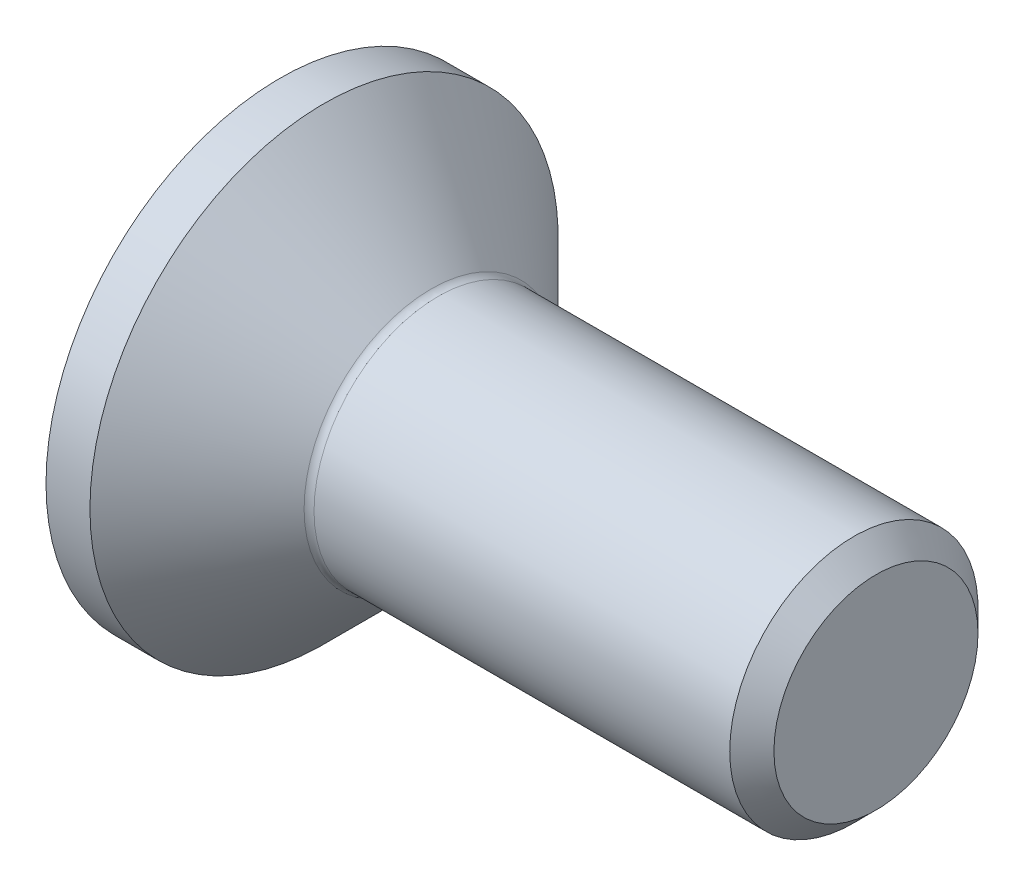
ISO-10303-21;
HEADER;
FILE_DESCRIPTION(('STEP AP214'),'2;1');
FILE_NAME('part.step','',(''),(''),'','','');
FILE_SCHEMA(('AUTOMOTIVE_DESIGN { 1 0 10303 214 1 1 1 1 }'));
ENDSEC;
DATA;
#1=APPLICATION_CONTEXT('core data for automotive mechanical design processes');
#2=APPLICATION_PROTOCOL_DEFINITION('international standard','automotive_design',2000,#1);
#3=PRODUCT_CONTEXT('',#1,'mechanical');
#4=PRODUCT('Part','Part','',(#3));
#5=PRODUCT_RELATED_PRODUCT_CATEGORY('part','',(#4));
#6=PRODUCT_DEFINITION_FORMATION('','',#4);
#7=PRODUCT_DEFINITION_CONTEXT('part definition',#1,'design');
#8=PRODUCT_DEFINITION('design','',#6,#7);
#9=PRODUCT_DEFINITION_SHAPE('','',#8);
#10=(LENGTH_UNIT() NAMED_UNIT(*) SI_UNIT(.MILLI.,.METRE.));
#11=(NAMED_UNIT(*) PLANE_ANGLE_UNIT() SI_UNIT($,.RADIAN.));
#12=(NAMED_UNIT(*) SI_UNIT($,.STERADIAN.) SOLID_ANGLE_UNIT());
#13=UNCERTAINTY_MEASURE_WITH_UNIT(LENGTH_MEASURE(1.E-05),#10,'distance_accuracy_value','');
#14=(GEOMETRIC_REPRESENTATION_CONTEXT(3) GLOBAL_UNCERTAINTY_ASSIGNED_CONTEXT((#13)) GLOBAL_UNIT_ASSIGNED_CONTEXT((#10,
#11,#12)) REPRESENTATION_CONTEXT('',''));
#15=CARTESIAN_POINT('',(0.,0.,0.));
#16=DIRECTION('',(0.,0.,1.));
#17=DIRECTION('',(1.,0.,0.));
#18=AXIS2_PLACEMENT_3D('',#15,#16,#17);
#19=CARTESIAN_POINT('',(0.,0.,0.));
#20=DIRECTION('',(-1.,0.,0.));
#21=DIRECTION('',(0.,0.,1.));
#22=AXIS2_PLACEMENT_3D('',#19,#20,#21);
#23=PLANE('',#22);
#24=CARTESIAN_POINT('',(0.,0.,0.));
#25=DIRECTION('',(-1.,0.,0.));
#26=DIRECTION('',(0.,0.,1.));
#27=AXIS2_PLACEMENT_3D('',#24,#25,#26);
#28=CIRCLE('',#27,4.715);
#29=CARTESIAN_POINT('',(0.,0.,4.715));
#30=VERTEX_POINT('',#29);
#31=EDGE_CURVE('E150',#30,#30,#28,.T.);
#32=ORIENTED_EDGE('',*,*,#31,.T.);
#33=EDGE_LOOP('',(#32));
#34=FACE_BOUND('',#33,.T.);
#35=DIRECTION('',(0.,-0.499999999999999,-0.866025403784439));
#36=VECTOR('',#35,1.);
#37=CARTESIAN_POINT('',(0.,-0.866025403784438,1.5));
#38=LINE('',#37,#36);
#39=CARTESIAN_POINT('',(0.,-0.866025403784438,1.5));
#40=VERTEX_POINT('',#39);
#41=CARTESIAN_POINT('',(0.,-1.73205080756887,0.));
#42=VERTEX_POINT('',#41);
#43=EDGE_CURVE('E116',#40,#42,#38,.T.);
#44=ORIENTED_EDGE('',*,*,#43,.T.);
#45=DIRECTION('',(0.,0.499999999999999,-0.866025403784439));
#46=VECTOR('',#45,1.);
#47=CARTESIAN_POINT('',(0.,-1.73205080756887,0.));
#48=LINE('',#47,#46);
#49=CARTESIAN_POINT('',(0.,-0.866025403784438,-1.5));
#50=VERTEX_POINT('',#49);
#51=EDGE_CURVE('E47',#42,#50,#48,.T.);
#52=ORIENTED_EDGE('',*,*,#51,.T.);
#53=DIRECTION('',(0.,1.,0.));
#54=VECTOR('',#53,1.);
#55=CARTESIAN_POINT('',(0.,-0.866025403784438,-1.5));
#56=LINE('',#55,#54);
#57=CARTESIAN_POINT('',(0.,0.866025403784438,-1.5));
#58=VERTEX_POINT('',#57);
#59=EDGE_CURVE('E127',#50,#58,#56,.T.);
#60=ORIENTED_EDGE('',*,*,#59,.T.);
#61=DIRECTION('',(0.,0.500000000000001,0.866025403784438));
#62=VECTOR('',#61,1.);
#63=CARTESIAN_POINT('',(0.,0.866025403784438,-1.5));
#64=LINE('',#63,#62);
#65=CARTESIAN_POINT('',(0.,1.73205080756888,0.));
#66=VERTEX_POINT('',#65);
#67=EDGE_CURVE('E251',#58,#66,#64,.T.);
#68=ORIENTED_EDGE('',*,*,#67,.T.);
#69=DIRECTION('',(0.,-0.5,0.866025403784438));
#70=VECTOR('',#69,1.);
#71=CARTESIAN_POINT('',(0.,1.73205080756888,0.));
#72=LINE('',#71,#70);
#73=CARTESIAN_POINT('',(0.,0.866025403784438,1.5));
#74=VERTEX_POINT('',#73);
#75=EDGE_CURVE('E254',#66,#74,#72,.T.);
#76=ORIENTED_EDGE('',*,*,#75,.T.);
#77=DIRECTION('',(0.,-1.,0.));
#78=VECTOR('',#77,1.);
#79=CARTESIAN_POINT('',(0.,0.866025403784438,1.5));
#80=LINE('',#79,#78);
#81=EDGE_CURVE('E257',#74,#40,#80,.T.);
#82=ORIENTED_EDGE('',*,*,#81,.T.);
#83=EDGE_LOOP('',(#44,#52,#60,#68,#76,#82));
#84=FACE_BOUND('',#83,.T.);
#85=ADVANCED_FACE('F32',(#34,#84),#23,.T.);
#86=CARTESIAN_POINT('',(0.,0.,0.));
#87=DIRECTION('',(-1.,0.,0.));
#88=DIRECTION('',(0.,0.,1.));
#89=AXIS2_PLACEMENT_3D('',#86,#87,#88);
#90=CYLINDRICAL_SURFACE('',#89,4.715);
#91=CARTESIAN_POINT('',(0.885000000000011,0.,0.));
#92=DIRECTION('',(-1.,0.,0.));
#93=DIRECTION('',(0.,0.,1.));
#94=AXIS2_PLACEMENT_3D('',#91,#92,#93);
#95=CIRCLE('',#94,4.715);
#96=CARTESIAN_POINT('',(0.885000000000011,0.,4.715));
#97=VERTEX_POINT('',#96);
#98=EDGE_CURVE('E147',#97,#97,#95,.T.);
#99=ORIENTED_EDGE('',*,*,#98,.T.);
#100=EDGE_LOOP('',(#99));
#101=FACE_BOUND('',#100,.T.);
#102=ORIENTED_EDGE('',*,*,#31,.F.);
#103=EDGE_LOOP('',(#102));
#104=FACE_BOUND('',#103,.T.);
#105=ADVANCED_FACE('F171',(#101,#104),#90,.T.);
#106=CARTESIAN_POINT('',(0.885000000000011,0.,0.));
#107=DIRECTION('',(-1.,0.,0.));
#108=DIRECTION('',(0.,0.,1.));
#109=AXIS2_PLACEMENT_3D('',#106,#107,#108);
#110=CONICAL_SURFACE('',#109,4.715,0.785398163397451);
#111=CARTESIAN_POINT('',(3.04142135623731,0.,0.));
#112=DIRECTION('',(-1.,0.,0.));
#113=DIRECTION('',(0.,0.,1.));
#114=AXIS2_PLACEMENT_3D('',#111,#112,#113);
#115=CIRCLE('',#114,2.55857864376269);
#116=CARTESIAN_POINT('',(3.04142135623731,0.,2.55857864376269));
#117=VERTEX_POINT('',#116);
#118=EDGE_CURVE('E40',#117,#117,#115,.T.);
#119=ORIENTED_EDGE('',*,*,#118,.T.);
#120=EDGE_LOOP('',(#119));
#121=FACE_BOUND('',#120,.T.);
#122=ORIENTED_EDGE('',*,*,#98,.F.);
#123=EDGE_LOOP('',(#122));
#124=FACE_BOUND('',#123,.T.);
#125=ADVANCED_FACE('F155',(#121,#124),#110,.T.);
#126=CARTESIAN_POINT('',(0.,0.,0.));
#127=DIRECTION('',(-1.,0.,0.));
#128=DIRECTION('',(0.,0.,1.));
#129=AXIS2_PLACEMENT_3D('',#126,#127,#128);
#130=CYLINDRICAL_SURFACE('',#129,2.5);
#131=CARTESIAN_POINT('',(3.18284271247462,0.,0.));
#132=DIRECTION('',(-1.,0.,0.));
#133=DIRECTION('',(0.,0.,1.));
#134=AXIS2_PLACEMENT_3D('',#131,#132,#133);
#135=CIRCLE('',#134,2.5);
#136=CARTESIAN_POINT('',(3.18284271247462,0.,2.5));
#137=VERTEX_POINT('',#136);
#138=EDGE_CURVE('E11',#137,#137,#135,.F.);
#139=ORIENTED_EDGE('',*,*,#138,.T.);
#140=EDGE_LOOP('',(#139));
#141=FACE_BOUND('',#140,.T.);
#142=CARTESIAN_POINT('',(11.555,0.,0.));
#143=DIRECTION('',(-1.,0.,0.));
#144=DIRECTION('',(0.,0.,1.));
#145=AXIS2_PLACEMENT_3D('',#142,#143,#144);
#146=CIRCLE('',#145,2.5);
#147=CARTESIAN_POINT('',(11.555,0.,2.5));
#148=VERTEX_POINT('',#147);
#149=EDGE_CURVE('E144',#148,#148,#146,.T.);
#150=ORIENTED_EDGE('',*,*,#149,.T.);
#151=EDGE_LOOP('',(#150));
#152=FACE_BOUND('',#151,.T.);
#153=ADVANCED_FACE('F182',(#141,#152),#130,.T.);
#154=CARTESIAN_POINT('',(12.,0.,0.));
#155=DIRECTION('',(-1.,0.,0.));
#156=DIRECTION('',(0.,0.,1.));
#157=AXIS2_PLACEMENT_3D('',#154,#155,#156);
#158=CONICAL_SURFACE('',#157,2.055,0.785398163397446);
#159=ORIENTED_EDGE('',*,*,#149,.F.);
#160=EDGE_LOOP('',(#159));
#161=FACE_BOUND('',#160,.T.);
#162=CARTESIAN_POINT('',(12.,0.,0.));
#163=DIRECTION('',(-1.,0.,0.));
#164=DIRECTION('',(0.,0.,1.));
#165=AXIS2_PLACEMENT_3D('',#162,#163,#164);
#166=CIRCLE('',#165,2.055);
#167=CARTESIAN_POINT('',(12.,0.,2.055));
#168=VERTEX_POINT('',#167);
#169=EDGE_CURVE('E140',#168,#168,#166,.T.);
#170=ORIENTED_EDGE('',*,*,#169,.T.);
#171=EDGE_LOOP('',(#170));
#172=FACE_BOUND('',#171,.T.);
#173=ADVANCED_FACE('F166',(#161,#172),#158,.T.);
#174=CARTESIAN_POINT('',(12.,2.055,0.));
#175=DIRECTION('',(1.,0.,0.));
#176=DIRECTION('',(0.,0.,-1.));
#177=AXIS2_PLACEMENT_3D('',#174,#175,#176);
#178=PLANE('',#177);
#179=ORIENTED_EDGE('',*,*,#169,.F.);
#180=EDGE_LOOP('',(#179));
#181=FACE_BOUND('',#180,.T.);
#182=ADVANCED_FACE('F159',(#181),#178,.T.);
#183=CARTESIAN_POINT('',(3.18284271247462,0.,0.));
#184=DIRECTION('',(-1.,0.,0.));
#185=DIRECTION('',(0.,0.,1.));
#186=AXIS2_PLACEMENT_3D('',#183,#184,#185);
#187=TOROIDAL_SURFACE('',#186,2.7,0.2);
#188=ORIENTED_EDGE('',*,*,#138,.F.);
#189=EDGE_LOOP('',(#188));
#190=FACE_BOUND('',#189,.T.);
#191=ORIENTED_EDGE('',*,*,#118,.F.);
#192=EDGE_LOOP('',(#191));
#193=FACE_BOUND('',#192,.T.);
#194=ADVANCED_FACE('F34',(#190,#193),#187,.F.);
#195=CARTESIAN_POINT('',(1.9,-1.73205080756887,0.));
#196=DIRECTION('',(0.,0.866025403784439,0.499999999999999));
#197=DIRECTION('',(0.,-0.499999999999999,0.866025403784439));
#198=AXIS2_PLACEMENT_3D('',#195,#196,#197);
#199=PLANE('',#198);
#200=ORIENTED_EDGE('',*,*,#51,.F.);
#201=DIRECTION('',(-1.,0.,0.));
#202=VECTOR('',#201,1.);
#203=CARTESIAN_POINT('',(1.9,-1.73205080756887,0.));
#204=LINE('',#203,#202);
#205=CARTESIAN_POINT('',(1.9,-1.73205080756887,0.));
#206=VERTEX_POINT('',#205);
#207=EDGE_CURVE('E248',#206,#42,#204,.T.);
#208=ORIENTED_EDGE('',*,*,#207,.F.);
#209=DIRECTION('',(0.,0.499999999999999,-0.866025403784439));
#210=VECTOR('',#209,1.);
#211=CARTESIAN_POINT('',(1.9,-1.73205080756887,0.));
#212=LINE('',#211,#210);
#213=CARTESIAN_POINT('',(1.9,-1.29903810567666,-0.749999999999998));
#214=VERTEX_POINT('',#213);
#215=EDGE_CURVE('E112',#206,#214,#212,.T.);
#216=ORIENTED_EDGE('',*,*,#215,.T.);
#217=CARTESIAN_POINT('',(1.9,-0.866025403784438,-1.5));
#218=VERTEX_POINT('',#217);
#219=EDGE_CURVE('E108',#214,#218,#212,.T.);
#220=ORIENTED_EDGE('',*,*,#219,.T.);
#221=DIRECTION('',(-1.,0.,0.));
#222=VECTOR('',#221,1.);
#223=CARTESIAN_POINT('',(1.9,-0.866025403784438,-1.5));
#224=LINE('',#223,#222);
#225=EDGE_CURVE('E110',#218,#50,#224,.T.);
#226=ORIENTED_EDGE('',*,*,#225,.T.);
#227=EDGE_LOOP('',(#200,#208,#216,#220,#226));
#228=FACE_BOUND('',#227,.T.);
#229=ADVANCED_FACE('F109',(#228),#199,.T.);
#230=CARTESIAN_POINT('',(1.9,-0.866025403784438,-1.5));
#231=DIRECTION('',(0.,0.,1.));
#232=DIRECTION('',(0.,-1.,0.));
#233=AXIS2_PLACEMENT_3D('',#230,#231,#232);
#234=PLANE('',#233);
#235=ORIENTED_EDGE('',*,*,#59,.F.);
#236=ORIENTED_EDGE('',*,*,#225,.F.);
#237=DIRECTION('',(0.,1.,0.));
#238=VECTOR('',#237,1.);
#239=CARTESIAN_POINT('',(1.9,-0.866025403784438,-1.5));
#240=LINE('',#239,#238);
#241=CARTESIAN_POINT('',(1.9,0.,-1.5));
#242=VERTEX_POINT('',#241);
#243=EDGE_CURVE('E55',#218,#242,#240,.T.);
#244=ORIENTED_EDGE('',*,*,#243,.T.);
#245=CARTESIAN_POINT('',(1.9,0.866025403784438,-1.5));
#246=VERTEX_POINT('',#245);
#247=EDGE_CURVE('E122',#242,#246,#240,.T.);
#248=ORIENTED_EDGE('',*,*,#247,.T.);
#249=DIRECTION('',(-1.,0.,0.));
#250=VECTOR('',#249,1.);
#251=CARTESIAN_POINT('',(1.9,0.866025403784438,-1.5));
#252=LINE('',#251,#250);
#253=EDGE_CURVE('E129',#246,#58,#252,.T.);
#254=ORIENTED_EDGE('',*,*,#253,.T.);
#255=EDGE_LOOP('',(#235,#236,#244,#248,#254));
#256=FACE_BOUND('',#255,.T.);
#257=ADVANCED_FACE('F124',(#256),#234,.T.);
#258=CARTESIAN_POINT('',(1.9,0.866025403784438,-1.5));
#259=DIRECTION('',(0.,-0.866025403784438,0.500000000000001));
#260=DIRECTION('',(0.,-0.500000000000001,-0.866025403784438));
#261=AXIS2_PLACEMENT_3D('',#258,#259,#260);
#262=PLANE('',#261);
#263=ORIENTED_EDGE('',*,*,#67,.F.);
#264=ORIENTED_EDGE('',*,*,#253,.F.);
#265=DIRECTION('',(0.,0.500000000000001,0.866025403784438));
#266=VECTOR('',#265,1.);
#267=CARTESIAN_POINT('',(1.9,0.866025403784438,-1.5));
#268=LINE('',#267,#266);
#269=CARTESIAN_POINT('',(1.9,1.29903810567666,-0.750000000000003));
#270=VERTEX_POINT('',#269);
#271=EDGE_CURVE('E229',#246,#270,#268,.T.);
#272=ORIENTED_EDGE('',*,*,#271,.T.);
#273=CARTESIAN_POINT('',(1.9,1.73205080756888,0.));
#274=VERTEX_POINT('',#273);
#275=EDGE_CURVE('E121',#270,#274,#268,.T.);
#276=ORIENTED_EDGE('',*,*,#275,.T.);
#277=DIRECTION('',(-1.,0.,0.));
#278=VECTOR('',#277,1.);
#279=CARTESIAN_POINT('',(1.9,1.73205080756888,0.));
#280=LINE('',#279,#278);
#281=EDGE_CURVE('E135',#274,#66,#280,.T.);
#282=ORIENTED_EDGE('',*,*,#281,.T.);
#283=EDGE_LOOP('',(#263,#264,#272,#276,#282));
#284=FACE_BOUND('',#283,.T.);
#285=ADVANCED_FACE('F196',(#284),#262,.T.);
#286=CARTESIAN_POINT('',(1.9,1.73205080756888,0.));
#287=DIRECTION('',(0.,-0.866025403784439,-0.5));
#288=DIRECTION('',(0.,0.5,-0.866025403784439));
#289=AXIS2_PLACEMENT_3D('',#286,#287,#288);
#290=PLANE('',#289);
#291=ORIENTED_EDGE('',*,*,#75,.F.);
#292=ORIENTED_EDGE('',*,*,#281,.F.);
#293=DIRECTION('',(0.,-0.5,0.866025403784438));
#294=VECTOR('',#293,1.);
#295=CARTESIAN_POINT('',(1.9,1.73205080756888,0.));
#296=LINE('',#295,#294);
#297=CARTESIAN_POINT('',(1.9,1.29903810567666,0.750000000000001));
#298=VERTEX_POINT('',#297);
#299=EDGE_CURVE('E236',#274,#298,#296,.T.);
#300=ORIENTED_EDGE('',*,*,#299,.T.);
#301=CARTESIAN_POINT('',(1.9,0.866025403784438,1.5));
#302=VERTEX_POINT('',#301);
#303=EDGE_CURVE('E234',#298,#302,#296,.T.);
#304=ORIENTED_EDGE('',*,*,#303,.T.);
#305=DIRECTION('',(-1.,0.,0.));
#306=VECTOR('',#305,1.);
#307=CARTESIAN_POINT('',(1.9,0.866025403784438,1.5));
#308=LINE('',#307,#306);
#309=EDGE_CURVE('E266',#302,#74,#308,.T.);
#310=ORIENTED_EDGE('',*,*,#309,.T.);
#311=EDGE_LOOP('',(#291,#292,#300,#304,#310));
#312=FACE_BOUND('',#311,.T.);
#313=ADVANCED_FACE('F199',(#312),#290,.T.);
#314=CARTESIAN_POINT('',(1.9,0.866025403784438,1.5));
#315=DIRECTION('',(0.,0.,-1.));
#316=DIRECTION('',(0.,1.,0.));
#317=AXIS2_PLACEMENT_3D('',#314,#315,#316);
#318=PLANE('',#317);
#319=ORIENTED_EDGE('',*,*,#81,.F.);
#320=ORIENTED_EDGE('',*,*,#309,.F.);
#321=DIRECTION('',(0.,-1.,0.));
#322=VECTOR('',#321,1.);
#323=CARTESIAN_POINT('',(1.9,0.866025403784438,1.5));
#324=LINE('',#323,#322);
#325=CARTESIAN_POINT('',(1.9,0.,1.5));
#326=VERTEX_POINT('',#325);
#327=EDGE_CURVE('E241',#302,#326,#324,.T.);
#328=ORIENTED_EDGE('',*,*,#327,.T.);
#329=CARTESIAN_POINT('',(1.9,-0.866025403784438,1.5));
#330=VERTEX_POINT('',#329);
#331=EDGE_CURVE('E240',#326,#330,#324,.T.);
#332=ORIENTED_EDGE('',*,*,#331,.T.);
#333=DIRECTION('',(-1.,0.,0.));
#334=VECTOR('',#333,1.);
#335=CARTESIAN_POINT('',(1.9,-0.866025403784438,1.5));
#336=LINE('',#335,#334);
#337=EDGE_CURVE('E263',#330,#40,#336,.T.);
#338=ORIENTED_EDGE('',*,*,#337,.T.);
#339=EDGE_LOOP('',(#319,#320,#328,#332,#338));
#340=FACE_BOUND('',#339,.T.);
#341=ADVANCED_FACE('F203',(#340),#318,.T.);
#342=CARTESIAN_POINT('',(1.9,-0.866025403784438,1.5));
#343=DIRECTION('',(0.,0.866025403784439,-0.499999999999999));
#344=DIRECTION('',(0.,0.499999999999999,0.866025403784439));
#345=AXIS2_PLACEMENT_3D('',#342,#343,#344);
#346=PLANE('',#345);
#347=ORIENTED_EDGE('',*,*,#43,.F.);
#348=ORIENTED_EDGE('',*,*,#337,.F.);
#349=DIRECTION('',(0.,-0.499999999999999,-0.866025403784439));
#350=VECTOR('',#349,1.);
#351=CARTESIAN_POINT('',(1.9,-0.866025403784438,1.5));
#352=LINE('',#351,#350);
#353=CARTESIAN_POINT('',(1.9,-1.29903810567666,0.749999999999997));
#354=VERTEX_POINT('',#353);
#355=EDGE_CURVE('E245',#330,#354,#352,.T.);
#356=ORIENTED_EDGE('',*,*,#355,.T.);
#357=EDGE_CURVE('E244',#354,#206,#352,.T.);
#358=ORIENTED_EDGE('',*,*,#357,.T.);
#359=ORIENTED_EDGE('',*,*,#207,.T.);
#360=EDGE_LOOP('',(#347,#348,#356,#358,#359));
#361=FACE_BOUND('',#360,.T.);
#362=ADVANCED_FACE('F207',(#361),#346,.T.);
#363=CARTESIAN_POINT('',(1.9,-0.866025403784437,-1.5));
#364=DIRECTION('',(1.,0.,0.));
#365=DIRECTION('',(0.,0.,-1.));
#366=AXIS2_PLACEMENT_3D('',#363,#364,#365);
#367=PLANE('',#366);
#368=ORIENTED_EDGE('',*,*,#243,.F.);
#369=ORIENTED_EDGE('',*,*,#219,.F.);
#370=CARTESIAN_POINT('',(1.9,0.,0.));
#371=DIRECTION('',(-1.,0.,0.));
#372=DIRECTION('',(0.,0.,1.));
#373=AXIS2_PLACEMENT_3D('',#370,#371,#372);
#374=CIRCLE('',#373,1.5);
#375=EDGE_CURVE('E119',#242,#214,#374,.T.);
#376=ORIENTED_EDGE('',*,*,#375,.F.);
#377=EDGE_LOOP('',(#368,#369,#376));
#378=FACE_BOUND('',#377,.T.);
#379=ADVANCED_FACE('F118',(#378),#367,.F.);
#380=ORIENTED_EDGE('',*,*,#215,.F.);
#381=ORIENTED_EDGE('',*,*,#357,.F.);
#382=EDGE_CURVE('E132',#214,#354,#374,.T.);
#383=ORIENTED_EDGE('',*,*,#382,.F.);
#384=EDGE_LOOP('',(#380,#381,#383));
#385=FACE_BOUND('',#384,.T.);
#386=ADVANCED_FACE('F213',(#385),#367,.F.);
#387=ORIENTED_EDGE('',*,*,#355,.F.);
#388=ORIENTED_EDGE('',*,*,#331,.F.);
#389=EDGE_CURVE('E128',#354,#326,#374,.T.);
#390=ORIENTED_EDGE('',*,*,#389,.F.);
#391=EDGE_LOOP('',(#387,#388,#390));
#392=FACE_BOUND('',#391,.T.);
#393=ADVANCED_FACE('F217',(#392),#367,.F.);
#394=ORIENTED_EDGE('',*,*,#327,.F.);
#395=ORIENTED_EDGE('',*,*,#303,.F.);
#396=EDGE_CURVE('E134',#326,#298,#374,.T.);
#397=ORIENTED_EDGE('',*,*,#396,.F.);
#398=EDGE_LOOP('',(#394,#395,#397));
#399=FACE_BOUND('',#398,.T.);
#400=ADVANCED_FACE('F225',(#399),#367,.F.);
#401=ORIENTED_EDGE('',*,*,#299,.F.);
#402=ORIENTED_EDGE('',*,*,#275,.F.);
#403=EDGE_CURVE('E141',#298,#270,#374,.T.);
#404=ORIENTED_EDGE('',*,*,#403,.F.);
#405=EDGE_LOOP('',(#401,#402,#404));
#406=FACE_BOUND('',#405,.T.);
#407=ADVANCED_FACE('F220',(#406),#367,.F.);
#408=ORIENTED_EDGE('',*,*,#271,.F.);
#409=ORIENTED_EDGE('',*,*,#247,.F.);
#410=EDGE_CURVE('E230',#270,#242,#374,.T.);
#411=ORIENTED_EDGE('',*,*,#410,.F.);
#412=EDGE_LOOP('',(#408,#409,#411));
#413=FACE_BOUND('',#412,.T.);
#414=ADVANCED_FACE('F191',(#413),#367,.F.);
#415=CARTESIAN_POINT('',(1.9,0.,0.));
#416=DIRECTION('',(-1.,0.,0.));
#417=DIRECTION('',(0.,0.,1.));
#418=AXIS2_PLACEMENT_3D('',#415,#416,#417);
#419=CONICAL_SURFACE('',#418,1.5,1.04719755119659);
#420=CARTESIAN_POINT('',(2.76602540378445,0.,0.));
#421=VERTEX_POINT('',#420);
#422=VERTEX_LOOP('',#421);
#423=FACE_BOUND('',#422,.T.);
#424=ORIENTED_EDGE('',*,*,#396,.T.);
#425=ORIENTED_EDGE('',*,*,#403,.T.);
#426=ORIENTED_EDGE('',*,*,#410,.T.);
#427=ORIENTED_EDGE('',*,*,#375,.T.);
#428=ORIENTED_EDGE('',*,*,#382,.T.);
#429=ORIENTED_EDGE('',*,*,#389,.T.);
#430=EDGE_LOOP('',(#424,#425,#426,#427,#428,#429));
#431=FACE_BOUND('',#430,.T.);
#432=ADVANCED_FACE('F189',(#423,#431),#419,.F.);
#433=CLOSED_SHELL('',(#85,#105,#125,#153,#173,#182,#194,#229,#257,#285,#313,#341,#362,#379,#386,
#393,#400,#407,#414,#432));
#434=MANIFOLD_SOLID_BREP('B2',#433);
#435=ADVANCED_BREP_SHAPE_REPRESENTATION('',(#18,#434),#14);
#436=SHAPE_DEFINITION_REPRESENTATION(#9,#435);
ENDSEC;
END-ISO-10303-21;
